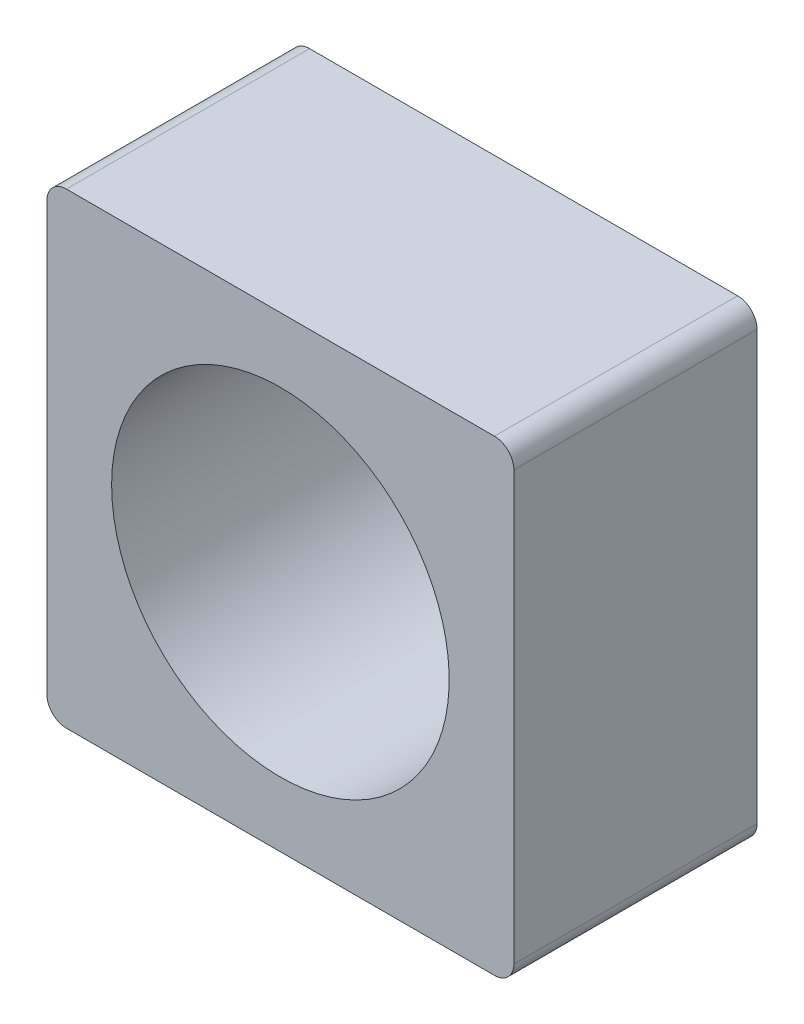
ISO-10303-21;
HEADER;
FILE_DESCRIPTION(('STEP AP214'),'2;1');
FILE_NAME('part.step','',(''),(''),'','','');
FILE_SCHEMA(('AUTOMOTIVE_DESIGN { 1 0 10303 214 1 1 1 1 }'));
ENDSEC;
DATA;
#1=APPLICATION_CONTEXT('core data for automotive mechanical design processes');
#2=APPLICATION_PROTOCOL_DEFINITION('international standard','automotive_design',2000,#1);
#3=PRODUCT_CONTEXT('',#1,'mechanical');
#4=PRODUCT('Part','Part','',(#3));
#5=PRODUCT_RELATED_PRODUCT_CATEGORY('part','',(#4));
#6=PRODUCT_DEFINITION_FORMATION('','',#4);
#7=PRODUCT_DEFINITION_CONTEXT('part definition',#1,'design');
#8=PRODUCT_DEFINITION('design','',#6,#7);
#9=PRODUCT_DEFINITION_SHAPE('','',#8);
#10=(LENGTH_UNIT() NAMED_UNIT(*) SI_UNIT(.MILLI.,.METRE.));
#11=(NAMED_UNIT(*) PLANE_ANGLE_UNIT() SI_UNIT($,.RADIAN.));
#12=(NAMED_UNIT(*) SI_UNIT($,.STERADIAN.) SOLID_ANGLE_UNIT());
#13=UNCERTAINTY_MEASURE_WITH_UNIT(LENGTH_MEASURE(1.E-05),#10,'distance_accuracy_value','');
#14=(GEOMETRIC_REPRESENTATION_CONTEXT(3) GLOBAL_UNCERTAINTY_ASSIGNED_CONTEXT((#13)) GLOBAL_UNIT_ASSIGNED_CONTEXT((#10,
#11,#12)) REPRESENTATION_CONTEXT('',''));
#15=CARTESIAN_POINT('',(0.,0.,0.));
#16=DIRECTION('',(0.,0.,1.));
#17=DIRECTION('',(1.,0.,0.));
#18=AXIS2_PLACEMENT_3D('',#15,#16,#17);
#19=CARTESIAN_POINT('',(2.2,-2.2,-2.5));
#20=DIRECTION('',(0.,0.,-1.));
#21=DIRECTION('',(-1.,0.,0.));
#22=AXIS2_PLACEMENT_3D('',#19,#20,#21);
#23=CYLINDRICAL_SURFACE('',#22,0.2);
#24=CARTESIAN_POINT('',(2.2,-2.2,0.));
#25=DIRECTION('',(0.,0.,-1.));
#26=DIRECTION('',(-1.,0.,0.));
#27=AXIS2_PLACEMENT_3D('',#24,#25,#26);
#28=CIRCLE('',#27,0.2);
#29=CARTESIAN_POINT('',(2.4,-2.2,0.));
#30=VERTEX_POINT('',#29);
#31=CARTESIAN_POINT('',(2.2,-2.4,0.));
#32=VERTEX_POINT('',#31);
#33=EDGE_CURVE('E146',#30,#32,#28,.T.);
#34=ORIENTED_EDGE('',*,*,#33,.T.);
#35=DIRECTION('',(0.,0.,1.));
#36=VECTOR('',#35,1.);
#37=CARTESIAN_POINT('',(2.2,-2.4,-2.5));
#38=LINE('',#37,#36);
#39=CARTESIAN_POINT('',(2.2,-2.4,-2.5));
#40=VERTEX_POINT('',#39);
#41=EDGE_CURVE('E97',#40,#32,#38,.T.);
#42=ORIENTED_EDGE('',*,*,#41,.F.);
#43=CARTESIAN_POINT('',(2.2,-2.2,-2.5));
#44=DIRECTION('',(0.,0.,-1.));
#45=DIRECTION('',(-1.,0.,0.));
#46=AXIS2_PLACEMENT_3D('',#43,#44,#45);
#47=CIRCLE('',#46,0.2);
#48=CARTESIAN_POINT('',(2.4,-2.2,-2.5));
#49=VERTEX_POINT('',#48);
#50=EDGE_CURVE('E20',#40,#49,#47,.F.);
#51=ORIENTED_EDGE('',*,*,#50,.T.);
#52=DIRECTION('',(0.,0.,-1.));
#53=VECTOR('',#52,1.);
#54=CARTESIAN_POINT('',(2.4,-2.2,-2.5));
#55=LINE('',#54,#53);
#56=EDGE_CURVE('E96',#30,#49,#55,.T.);
#57=ORIENTED_EDGE('',*,*,#56,.F.);
#58=EDGE_LOOP('',(#34,#42,#51,#57));
#59=FACE_BOUND('',#58,.T.);
#60=ADVANCED_FACE('F17',(#59),#23,.T.);
#61=CARTESIAN_POINT('',(2.2,2.2,-2.5));
#62=DIRECTION('',(0.,0.,-1.));
#63=DIRECTION('',(-1.,0.,0.));
#64=AXIS2_PLACEMENT_3D('',#61,#62,#63);
#65=CYLINDRICAL_SURFACE('',#64,0.2);
#66=CARTESIAN_POINT('',(2.2,2.2,0.));
#67=DIRECTION('',(0.,0.,-1.));
#68=DIRECTION('',(-1.,0.,0.));
#69=AXIS2_PLACEMENT_3D('',#66,#67,#68);
#70=CIRCLE('',#69,0.2);
#71=CARTESIAN_POINT('',(2.2,2.4,0.));
#72=VERTEX_POINT('',#71);
#73=CARTESIAN_POINT('',(2.4,2.2,0.));
#74=VERTEX_POINT('',#73);
#75=EDGE_CURVE('E143',#72,#74,#70,.T.);
#76=ORIENTED_EDGE('',*,*,#75,.T.);
#77=DIRECTION('',(0.,0.,-1.));
#78=VECTOR('',#77,1.);
#79=CARTESIAN_POINT('',(2.4,2.2,-2.5));
#80=LINE('',#79,#78);
#81=CARTESIAN_POINT('',(2.4,2.2,-2.5));
#82=VERTEX_POINT('',#81);
#83=EDGE_CURVE('E130',#82,#74,#80,.F.);
#84=ORIENTED_EDGE('',*,*,#83,.F.);
#85=CARTESIAN_POINT('',(2.2,2.2,-2.5));
#86=DIRECTION('',(0.,0.,-1.));
#87=DIRECTION('',(-1.,0.,0.));
#88=AXIS2_PLACEMENT_3D('',#85,#86,#87);
#89=CIRCLE('',#88,0.2);
#90=CARTESIAN_POINT('',(2.2,2.4,-2.5));
#91=VERTEX_POINT('',#90);
#92=EDGE_CURVE('E145',#82,#91,#89,.F.);
#93=ORIENTED_EDGE('',*,*,#92,.T.);
#94=DIRECTION('',(0.,0.,1.));
#95=VECTOR('',#94,1.);
#96=CARTESIAN_POINT('',(2.2,2.4,-2.5));
#97=LINE('',#96,#95);
#98=EDGE_CURVE('E124',#72,#91,#97,.F.);
#99=ORIENTED_EDGE('',*,*,#98,.F.);
#100=EDGE_LOOP('',(#76,#84,#93,#99));
#101=FACE_BOUND('',#100,.T.);
#102=ADVANCED_FACE('F154',(#101),#65,.T.);
#103=CARTESIAN_POINT('',(-2.2,-2.2,-2.5));
#104=DIRECTION('',(0.,0.,-1.));
#105=DIRECTION('',(-1.,0.,0.));
#106=AXIS2_PLACEMENT_3D('',#103,#104,#105);
#107=CYLINDRICAL_SURFACE('',#106,0.2);
#108=CARTESIAN_POINT('',(-2.2,-2.2,0.));
#109=DIRECTION('',(0.,0.,-1.));
#110=DIRECTION('',(-1.,0.,0.));
#111=AXIS2_PLACEMENT_3D('',#108,#109,#110);
#112=CIRCLE('',#111,0.2);
#113=CARTESIAN_POINT('',(-2.2,-2.4,0.));
#114=VERTEX_POINT('',#113);
#115=CARTESIAN_POINT('',(-2.4,-2.2,0.));
#116=VERTEX_POINT('',#115);
#117=EDGE_CURVE('E35',#114,#116,#112,.T.);
#118=ORIENTED_EDGE('',*,*,#117,.T.);
#119=DIRECTION('',(0.,0.,1.));
#120=VECTOR('',#119,1.);
#121=CARTESIAN_POINT('',(-2.4,-2.2,-2.5));
#122=LINE('',#121,#120);
#123=CARTESIAN_POINT('',(-2.4,-2.2,-2.5));
#124=VERTEX_POINT('',#123);
#125=EDGE_CURVE('E122',#124,#116,#122,.T.);
#126=ORIENTED_EDGE('',*,*,#125,.F.);
#127=CARTESIAN_POINT('',(-2.2,-2.2,-2.5));
#128=DIRECTION('',(0.,0.,-1.));
#129=DIRECTION('',(-1.,0.,0.));
#130=AXIS2_PLACEMENT_3D('',#127,#128,#129);
#131=CIRCLE('',#130,0.2);
#132=CARTESIAN_POINT('',(-2.2,-2.4,-2.5));
#133=VERTEX_POINT('',#132);
#134=EDGE_CURVE('E89',#124,#133,#131,.F.);
#135=ORIENTED_EDGE('',*,*,#134,.T.);
#136=DIRECTION('',(0.,0.,1.));
#137=VECTOR('',#136,1.);
#138=CARTESIAN_POINT('',(-2.2,-2.4,-2.5));
#139=LINE('',#138,#137);
#140=EDGE_CURVE('E92',#114,#133,#139,.F.);
#141=ORIENTED_EDGE('',*,*,#140,.F.);
#142=EDGE_LOOP('',(#118,#126,#135,#141));
#143=FACE_BOUND('',#142,.T.);
#144=ADVANCED_FACE('F93',(#143),#107,.T.);
#145=CARTESIAN_POINT('',(-2.2,2.2,-2.5));
#146=DIRECTION('',(0.,0.,-1.));
#147=DIRECTION('',(-1.,0.,0.));
#148=AXIS2_PLACEMENT_3D('',#145,#146,#147);
#149=CYLINDRICAL_SURFACE('',#148,0.2);
#150=CARTESIAN_POINT('',(-2.2,2.2,0.));
#151=DIRECTION('',(0.,0.,-1.));
#152=DIRECTION('',(-1.,0.,0.));
#153=AXIS2_PLACEMENT_3D('',#150,#151,#152);
#154=CIRCLE('',#153,0.2);
#155=CARTESIAN_POINT('',(-2.4,2.2,0.));
#156=VERTEX_POINT('',#155);
#157=CARTESIAN_POINT('',(-2.2,2.4,0.));
#158=VERTEX_POINT('',#157);
#159=EDGE_CURVE('E134',#156,#158,#154,.T.);
#160=ORIENTED_EDGE('',*,*,#159,.T.);
#161=DIRECTION('',(0.,0.,1.));
#162=VECTOR('',#161,1.);
#163=CARTESIAN_POINT('',(-2.2,2.4,-2.5));
#164=LINE('',#163,#162);
#165=CARTESIAN_POINT('',(-2.2,2.4,-2.5));
#166=VERTEX_POINT('',#165);
#167=EDGE_CURVE('E127',#166,#158,#164,.T.);
#168=ORIENTED_EDGE('',*,*,#167,.F.);
#169=CARTESIAN_POINT('',(-2.2,2.2,-2.5));
#170=DIRECTION('',(0.,0.,-1.));
#171=DIRECTION('',(-1.,0.,0.));
#172=AXIS2_PLACEMENT_3D('',#169,#170,#171);
#173=CIRCLE('',#172,0.2);
#174=CARTESIAN_POINT('',(-2.4,2.2,-2.5));
#175=VERTEX_POINT('',#174);
#176=EDGE_CURVE('E88',#166,#175,#173,.F.);
#177=ORIENTED_EDGE('',*,*,#176,.T.);
#178=DIRECTION('',(0.,0.,1.));
#179=VECTOR('',#178,1.);
#180=CARTESIAN_POINT('',(-2.4,2.2,-2.5));
#181=LINE('',#180,#179);
#182=EDGE_CURVE('E119',#156,#175,#181,.F.);
#183=ORIENTED_EDGE('',*,*,#182,.F.);
#184=EDGE_LOOP('',(#160,#168,#177,#183));
#185=FACE_BOUND('',#184,.T.);
#186=ADVANCED_FACE('F166',(#185),#149,.T.);
#187=CARTESIAN_POINT('',(-2.4,-2.4,-2.5));
#188=DIRECTION('',(0.,-1.,0.));
#189=DIRECTION('',(1.,0.,0.));
#190=AXIS2_PLACEMENT_3D('',#187,#188,#189);
#191=PLANE('',#190);
#192=DIRECTION('',(1.,0.,0.));
#193=VECTOR('',#192,1.);
#194=CARTESIAN_POINT('',(-2.4,-2.4,0.));
#195=LINE('',#194,#193);
#196=EDGE_CURVE('E85',#114,#32,#195,.T.);
#197=ORIENTED_EDGE('',*,*,#196,.F.);
#198=ORIENTED_EDGE('',*,*,#140,.T.);
#199=DIRECTION('',(1.,0.,0.));
#200=VECTOR('',#199,1.);
#201=CARTESIAN_POINT('',(-2.4,-2.4,-2.5));
#202=LINE('',#201,#200);
#203=EDGE_CURVE('E108',#133,#40,#202,.T.);
#204=ORIENTED_EDGE('',*,*,#203,.T.);
#205=ORIENTED_EDGE('',*,*,#41,.T.);
#206=EDGE_LOOP('',(#197,#198,#204,#205));
#207=FACE_BOUND('',#206,.T.);
#208=ADVANCED_FACE('F100',(#207),#191,.T.);
#209=CARTESIAN_POINT('',(2.4,-2.4,-2.5));
#210=DIRECTION('',(1.,0.,0.));
#211=DIRECTION('',(0.,0.,-1.));
#212=AXIS2_PLACEMENT_3D('',#209,#210,#211);
#213=PLANE('',#212);
#214=DIRECTION('',(0.,1.,0.));
#215=VECTOR('',#214,1.);
#216=CARTESIAN_POINT('',(2.4,-2.4,-2.5));
#217=LINE('',#216,#215);
#218=EDGE_CURVE('E102',#49,#82,#217,.T.);
#219=ORIENTED_EDGE('',*,*,#218,.T.);
#220=ORIENTED_EDGE('',*,*,#83,.T.);
#221=DIRECTION('',(0.,1.,0.));
#222=VECTOR('',#221,1.);
#223=CARTESIAN_POINT('',(2.4,-2.4,0.));
#224=LINE('',#223,#222);
#225=EDGE_CURVE('E101',#30,#74,#224,.T.);
#226=ORIENTED_EDGE('',*,*,#225,.F.);
#227=ORIENTED_EDGE('',*,*,#56,.T.);
#228=EDGE_LOOP('',(#219,#220,#226,#227));
#229=FACE_BOUND('',#228,.T.);
#230=ADVANCED_FACE('F151',(#229),#213,.T.);
#231=CARTESIAN_POINT('',(2.4,2.4,-2.5));
#232=DIRECTION('',(0.,1.,0.));
#233=DIRECTION('',(-1.,0.,0.));
#234=AXIS2_PLACEMENT_3D('',#231,#232,#233);
#235=PLANE('',#234);
#236=DIRECTION('',(1.,0.,0.));
#237=VECTOR('',#236,1.);
#238=CARTESIAN_POINT('',(-2.4,2.4,0.));
#239=LINE('',#238,#237);
#240=EDGE_CURVE('E105',#72,#158,#239,.F.);
#241=ORIENTED_EDGE('',*,*,#240,.F.);
#242=ORIENTED_EDGE('',*,*,#98,.T.);
#243=DIRECTION('',(1.,0.,0.));
#244=VECTOR('',#243,1.);
#245=CARTESIAN_POINT('',(-2.4,2.4,-2.5));
#246=LINE('',#245,#244);
#247=EDGE_CURVE('E116',#91,#166,#246,.F.);
#248=ORIENTED_EDGE('',*,*,#247,.T.);
#249=ORIENTED_EDGE('',*,*,#167,.T.);
#250=EDGE_LOOP('',(#241,#242,#248,#249));
#251=FACE_BOUND('',#250,.T.);
#252=ADVANCED_FACE('F158',(#251),#235,.T.);
#253=CARTESIAN_POINT('',(-2.4,2.4,-2.5));
#254=DIRECTION('',(-1.,0.,0.));
#255=DIRECTION('',(0.,0.,1.));
#256=AXIS2_PLACEMENT_3D('',#253,#254,#255);
#257=PLANE('',#256);
#258=DIRECTION('',(0.,1.,0.));
#259=VECTOR('',#258,1.);
#260=CARTESIAN_POINT('',(-2.4,-2.4,0.));
#261=LINE('',#260,#259);
#262=EDGE_CURVE('E87',#156,#116,#261,.F.);
#263=ORIENTED_EDGE('',*,*,#262,.F.);
#264=ORIENTED_EDGE('',*,*,#182,.T.);
#265=DIRECTION('',(0.,1.,0.));
#266=VECTOR('',#265,1.);
#267=CARTESIAN_POINT('',(-2.4,-2.4,-2.5));
#268=LINE('',#267,#266);
#269=EDGE_CURVE('E113',#175,#124,#268,.F.);
#270=ORIENTED_EDGE('',*,*,#269,.T.);
#271=ORIENTED_EDGE('',*,*,#125,.T.);
#272=EDGE_LOOP('',(#263,#264,#270,#271));
#273=FACE_BOUND('',#272,.T.);
#274=ADVANCED_FACE('F169',(#273),#257,.T.);
#275=CARTESIAN_POINT('',(-2.4,-2.4,-2.5));
#276=DIRECTION('',(0.,0.,1.));
#277=DIRECTION('',(1.,0.,0.));
#278=AXIS2_PLACEMENT_3D('',#275,#276,#277);
#279=PLANE('',#278);
#280=CARTESIAN_POINT('',(0.,0.,-2.5));
#281=DIRECTION('',(0.,0.,-1.));
#282=DIRECTION('',(-1.,0.,0.));
#283=AXIS2_PLACEMENT_3D('',#280,#281,#282);
#284=CIRCLE('',#283,1.735);
#285=CARTESIAN_POINT('',(-1.735,0.,-2.5));
#286=VERTEX_POINT('',#285);
#287=EDGE_CURVE('E26',#286,#286,#284,.F.);
#288=ORIENTED_EDGE('',*,*,#287,.T.);
#289=EDGE_LOOP('',(#288));
#290=FACE_BOUND('',#289,.T.);
#291=ORIENTED_EDGE('',*,*,#50,.F.);
#292=ORIENTED_EDGE('',*,*,#203,.F.);
#293=ORIENTED_EDGE('',*,*,#134,.F.);
#294=ORIENTED_EDGE('',*,*,#269,.F.);
#295=ORIENTED_EDGE('',*,*,#176,.F.);
#296=ORIENTED_EDGE('',*,*,#247,.F.);
#297=ORIENTED_EDGE('',*,*,#92,.F.);
#298=ORIENTED_EDGE('',*,*,#218,.F.);
#299=EDGE_LOOP('',(#291,#292,#293,#294,#295,#296,#297,#298));
#300=FACE_BOUND('',#299,.T.);
#301=ADVANCED_FACE('F170',(#290,#300),#279,.F.);
#302=CARTESIAN_POINT('',(-2.4,-2.4,0.));
#303=DIRECTION('',(0.,0.,1.));
#304=DIRECTION('',(1.,0.,0.));
#305=AXIS2_PLACEMENT_3D('',#302,#303,#304);
#306=PLANE('',#305);
#307=ORIENTED_EDGE('',*,*,#262,.T.);
#308=ORIENTED_EDGE('',*,*,#117,.F.);
#309=ORIENTED_EDGE('',*,*,#196,.T.);
#310=ORIENTED_EDGE('',*,*,#33,.F.);
#311=ORIENTED_EDGE('',*,*,#225,.T.);
#312=ORIENTED_EDGE('',*,*,#75,.F.);
#313=ORIENTED_EDGE('',*,*,#240,.T.);
#314=ORIENTED_EDGE('',*,*,#159,.F.);
#315=EDGE_LOOP('',(#307,#308,#309,#310,#311,#312,#313,#314));
#316=FACE_BOUND('',#315,.T.);
#317=CARTESIAN_POINT('',(0.,0.,0.));
#318=DIRECTION('',(0.,0.,-1.));
#319=DIRECTION('',(-1.,0.,0.));
#320=AXIS2_PLACEMENT_3D('',#317,#318,#319);
#321=CIRCLE('',#320,1.735);
#322=CARTESIAN_POINT('',(-1.735,0.,0.));
#323=VERTEX_POINT('',#322);
#324=EDGE_CURVE('E11',#323,#323,#321,.T.);
#325=ORIENTED_EDGE('',*,*,#324,.T.);
#326=EDGE_LOOP('',(#325));
#327=FACE_BOUND('',#326,.T.);
#328=ADVANCED_FACE('F82',(#316,#327),#306,.T.);
#329=CARTESIAN_POINT('',(0.,0.,-7.233947746563));
#330=DIRECTION('',(0.,0.,-1.));
#331=DIRECTION('',(-1.,0.,0.));
#332=AXIS2_PLACEMENT_3D('',#329,#330,#331);
#333=CYLINDRICAL_SURFACE('',#332,1.735);
#334=ORIENTED_EDGE('',*,*,#324,.F.);
#335=EDGE_LOOP('',(#334));
#336=FACE_BOUND('',#335,.T.);
#337=ORIENTED_EDGE('',*,*,#287,.F.);
#338=EDGE_LOOP('',(#337));
#339=FACE_BOUND('',#338,.T.);
#340=ADVANCED_FACE('F179',(#336,#339),#333,.F.);
#341=CLOSED_SHELL('',(#60,#102,#144,#186,#208,#230,#252,#274,#301,#328,#340));
#342=MANIFOLD_SOLID_BREP('B1',#341);
#343=ADVANCED_BREP_SHAPE_REPRESENTATION('',(#18,#342),#14);
#344=SHAPE_DEFINITION_REPRESENTATION(#9,#343);
ENDSEC;
END-ISO-10303-21;
